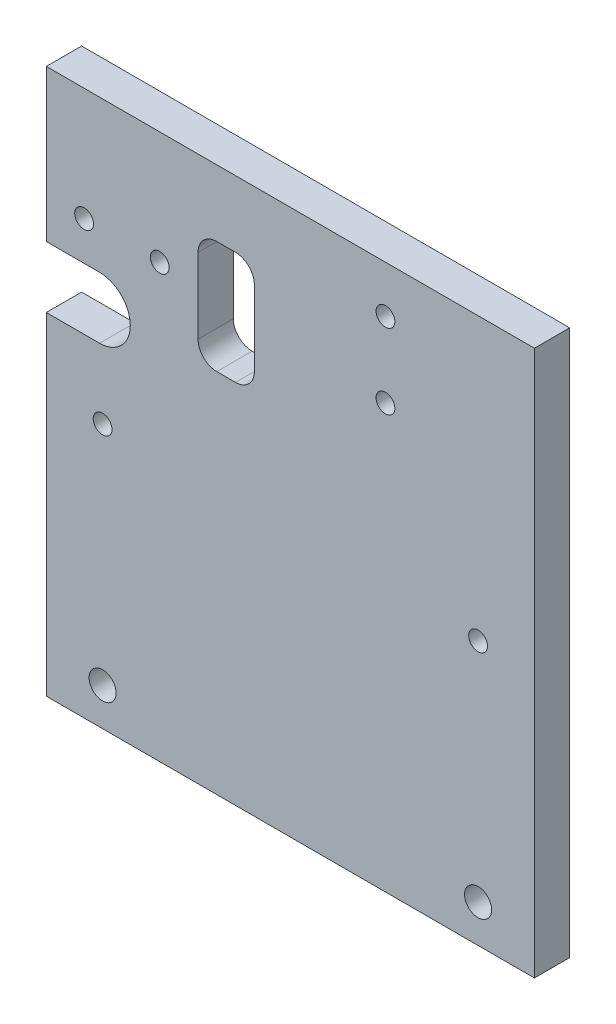
ISO-10303-21;
HEADER;
FILE_DESCRIPTION(('STEP AP214'),'2;1');
FILE_NAME('part.step','',(''),(''),'','','');
FILE_SCHEMA(('AUTOMOTIVE_DESIGN { 1 0 10303 214 1 1 1 1 }'));
ENDSEC;
DATA;
#1=APPLICATION_CONTEXT('core data for automotive mechanical design processes');
#2=APPLICATION_PROTOCOL_DEFINITION('international standard','automotive_design',2000,#1);
#3=PRODUCT_CONTEXT('',#1,'mechanical');
#4=PRODUCT('Part','Part','',(#3));
#5=PRODUCT_RELATED_PRODUCT_CATEGORY('part','',(#4));
#6=PRODUCT_DEFINITION_FORMATION('','',#4);
#7=PRODUCT_DEFINITION_CONTEXT('part definition',#1,'design');
#8=PRODUCT_DEFINITION('design','',#6,#7);
#9=PRODUCT_DEFINITION_SHAPE('','',#8);
#10=(LENGTH_UNIT() NAMED_UNIT(*) SI_UNIT(.MILLI.,.METRE.));
#11=(NAMED_UNIT(*) PLANE_ANGLE_UNIT() SI_UNIT($,.RADIAN.));
#12=(NAMED_UNIT(*) SI_UNIT($,.STERADIAN.) SOLID_ANGLE_UNIT());
#13=UNCERTAINTY_MEASURE_WITH_UNIT(LENGTH_MEASURE(1.E-05),#10,'distance_accuracy_value','');
#14=(GEOMETRIC_REPRESENTATION_CONTEXT(3) GLOBAL_UNCERTAINTY_ASSIGNED_CONTEXT((#13)) GLOBAL_UNIT_ASSIGNED_CONTEXT((#10,
#11,#12)) REPRESENTATION_CONTEXT('',''));
#15=CARTESIAN_POINT('',(0.,0.,0.));
#16=DIRECTION('',(0.,0.,1.));
#17=DIRECTION('',(1.,0.,0.));
#18=AXIS2_PLACEMENT_3D('',#15,#16,#17);
#19=CARTESIAN_POINT('',(-15.,-10.,9.4));
#20=DIRECTION('',(1.,0.,0.));
#21=DIRECTION('',(0.,0.,-1.));
#22=AXIS2_PLACEMENT_3D('',#19,#20,#21);
#23=PLANE('',#22);
#24=DIRECTION('',(0.,-1.,0.));
#25=VECTOR('',#24,1.);
#26=CARTESIAN_POINT('',(-15.,-10.,9.4));
#27=LINE('',#26,#25);
#28=CARTESIAN_POINT('',(-15.,78.5,9.4));
#29=VERTEX_POINT('',#28);
#30=CARTESIAN_POINT('',(-15.,-10.,9.4));
#31=VERTEX_POINT('',#30);
#32=EDGE_CURVE('E291',#29,#31,#27,.T.);
#33=ORIENTED_EDGE('',*,*,#32,.F.);
#34=DIRECTION('',(0.,0.,1.));
#35=VECTOR('',#34,1.);
#36=CARTESIAN_POINT('',(-15.,78.5,0.));
#37=LINE('',#36,#35);
#38=CARTESIAN_POINT('',(-15.,78.5,0.));
#39=VERTEX_POINT('',#38);
#40=EDGE_CURVE('E184',#39,#29,#37,.T.);
#41=ORIENTED_EDGE('',*,*,#40,.F.);
#42=DIRECTION('',(0.,-1.,0.));
#43=VECTOR('',#42,1.);
#44=CARTESIAN_POINT('',(-15.,-10.,0.));
#45=LINE('',#44,#43);
#46=CARTESIAN_POINT('',(-15.,-10.,0.));
#47=VERTEX_POINT('',#46);
#48=EDGE_CURVE('E172',#39,#47,#45,.T.);
#49=ORIENTED_EDGE('',*,*,#48,.T.);
#50=DIRECTION('',(0.,0.,-1.));
#51=VECTOR('',#50,1.);
#52=CARTESIAN_POINT('',(-15.,-10.,9.4));
#53=LINE('',#52,#51);
#54=EDGE_CURVE('E11',#31,#47,#53,.T.);
#55=ORIENTED_EDGE('',*,*,#54,.F.);
#56=EDGE_LOOP('',(#33,#41,#49,#55));
#57=FACE_BOUND('',#56,.T.);
#58=ADVANCED_FACE('F35',(#57),#23,.F.);
#59=CARTESIAN_POINT('',(0.,0.,9.4));
#60=DIRECTION('',(0.,0.,-1.));
#61=DIRECTION('',(-1.,0.,0.));
#62=AXIS2_PLACEMENT_3D('',#59,#60,#61);
#63=PLANE('',#62);
#64=CARTESIAN_POINT('',(-4.92685684419969,105.18600000001,9.4));
#65=DIRECTION('',(0.,0.,1.));
#66=DIRECTION('',(1.,0.,0.));
#67=AXIS2_PLACEMENT_3D('',#64,#65,#66);
#68=CIRCLE('',#67,2.5);
#69=CARTESIAN_POINT('',(-2.42685684419969,105.18600000001,9.4));
#70=VERTEX_POINT('',#69);
#71=EDGE_CURVE('E618',#70,#70,#68,.T.);
#72=ORIENTED_EDGE('',*,*,#71,.F.);
#73=EDGE_LOOP('',(#72));
#74=FACE_BOUND('',#73,.T.);
#75=CARTESIAN_POINT('',(15.2153431558003,105.18600000001,9.4));
#76=DIRECTION('',(0.,0.,1.));
#77=DIRECTION('',(1.,0.,0.));
#78=AXIS2_PLACEMENT_3D('',#75,#76,#77);
#79=CIRCLE('',#78,2.5);
#80=CARTESIAN_POINT('',(17.7153431558003,105.18600000001,9.4));
#81=VERTEX_POINT('',#80);
#82=EDGE_CURVE('E177',#81,#81,#79,.T.);
#83=ORIENTED_EDGE('',*,*,#82,.F.);
#84=EDGE_LOOP('',(#83));
#85=FACE_BOUND('',#84,.T.);
#86=DIRECTION('',(-1.,0.,0.));
#87=VECTOR('',#86,1.);
#88=CARTESIAN_POINT('',(35.4075461399999,87.5703674948168,9.4));
#89=LINE('',#88,#87);
#90=CARTESIAN_POINT('',(35.4075461399999,87.5703674948168,9.4));
#91=VERTEX_POINT('',#90);
#92=CARTESIAN_POINT('',(30.4075461399999,87.5703674948168,9.4));
#93=VERTEX_POINT('',#92);
#94=EDGE_CURVE('E210',#91,#93,#89,.T.);
#95=ORIENTED_EDGE('',*,*,#94,.T.);
#96=CARTESIAN_POINT('',(30.4075461399999,92.5703674948168,9.4));
#97=DIRECTION('',(0.,0.,-1.));
#98=DIRECTION('',(1.,0.,0.));
#99=AXIS2_PLACEMENT_3D('',#96,#97,#98);
#100=CIRCLE('',#99,5.);
#101=CARTESIAN_POINT('',(25.4075461399999,92.5703674948168,9.4));
#102=VERTEX_POINT('',#101);
#103=EDGE_CURVE('E190',#93,#102,#100,.T.);
#104=ORIENTED_EDGE('',*,*,#103,.T.);
#105=DIRECTION('',(0.,1.,0.));
#106=VECTOR('',#105,1.);
#107=CARTESIAN_POINT('',(25.4075461399999,112.570367494817,9.4));
#108=LINE('',#107,#106);
#109=CARTESIAN_POINT('',(25.4075461399999,112.570367494817,9.4));
#110=VERTEX_POINT('',#109);
#111=EDGE_CURVE('E193',#102,#110,#108,.T.);
#112=ORIENTED_EDGE('',*,*,#111,.T.);
#113=CARTESIAN_POINT('',(30.4075461399999,112.570367494817,9.4));
#114=DIRECTION('',(0.,0.,-1.));
#115=DIRECTION('',(1.,0.,0.));
#116=AXIS2_PLACEMENT_3D('',#113,#114,#115);
#117=CIRCLE('',#116,5.);
#118=CARTESIAN_POINT('',(30.4075461399999,117.570367494817,9.4));
#119=VERTEX_POINT('',#118);
#120=EDGE_CURVE('E58',#110,#119,#117,.T.);
#121=ORIENTED_EDGE('',*,*,#120,.T.);
#122=DIRECTION('',(1.,0.,0.));
#123=VECTOR('',#122,1.);
#124=CARTESIAN_POINT('',(35.4075461399999,117.570367494817,9.4));
#125=LINE('',#124,#123);
#126=CARTESIAN_POINT('',(35.4075461399999,117.570367494817,9.4));
#127=VERTEX_POINT('',#126);
#128=EDGE_CURVE('E198',#119,#127,#125,.T.);
#129=ORIENTED_EDGE('',*,*,#128,.T.);
#130=CARTESIAN_POINT('',(35.4075461399999,112.570367494817,9.4));
#131=DIRECTION('',(0.,0.,-1.));
#132=DIRECTION('',(1.,0.,0.));
#133=AXIS2_PLACEMENT_3D('',#130,#131,#132);
#134=CIRCLE('',#133,5.);
#135=CARTESIAN_POINT('',(40.4075461399999,112.570367494817,9.4));
#136=VERTEX_POINT('',#135);
#137=EDGE_CURVE('E201',#127,#136,#134,.T.);
#138=ORIENTED_EDGE('',*,*,#137,.T.);
#139=DIRECTION('',(0.,-1.,0.));
#140=VECTOR('',#139,1.);
#141=CARTESIAN_POINT('',(40.4075461399999,112.570367494817,9.4));
#142=LINE('',#141,#140);
#143=CARTESIAN_POINT('',(40.4075461399999,92.5703674948168,9.4));
#144=VERTEX_POINT('',#143);
#145=EDGE_CURVE('E204',#136,#144,#142,.T.);
#146=ORIENTED_EDGE('',*,*,#145,.T.);
#147=CARTESIAN_POINT('',(35.4075461399999,92.5703674948168,9.4));
#148=DIRECTION('',(0.,0.,-1.));
#149=DIRECTION('',(1.,0.,0.));
#150=AXIS2_PLACEMENT_3D('',#147,#148,#149);
#151=CIRCLE('',#150,5.);
#152=EDGE_CURVE('E207',#144,#91,#151,.T.);
#153=ORIENTED_EDGE('',*,*,#152,.T.);
#154=EDGE_LOOP('',(#95,#104,#112,#121,#129,#138,#146,#153));
#155=FACE_BOUND('',#154,.T.);
#156=CARTESIAN_POINT('',(75.3299999999999,122.76641156761,9.4));
#157=DIRECTION('',(0.,0.,1.));
#158=DIRECTION('',(1.,0.,0.));
#159=AXIS2_PLACEMENT_3D('',#156,#157,#158);
#160=CIRCLE('',#159,2.5);
#161=CARTESIAN_POINT('',(77.8299999999999,122.76641156761,9.4));
#162=VERTEX_POINT('',#161);
#163=EDGE_CURVE('E256',#162,#162,#160,.T.);
#164=ORIENTED_EDGE('',*,*,#163,.F.);
#165=EDGE_LOOP('',(#164));
#166=FACE_BOUND('',#165,.T.);
#167=CARTESIAN_POINT('',(75.3299999999999,102.76641156761,9.4));
#168=DIRECTION('',(0.,0.,1.));
#169=DIRECTION('',(1.,0.,0.));
#170=AXIS2_PLACEMENT_3D('',#167,#168,#169);
#171=CIRCLE('',#170,2.5);
#172=CARTESIAN_POINT('',(77.8299999999999,102.76641156761,9.4));
#173=VERTEX_POINT('',#172);
#174=EDGE_CURVE('E237',#173,#173,#171,.T.);
#175=ORIENTED_EDGE('',*,*,#174,.F.);
#176=EDGE_LOOP('',(#175));
#177=FACE_BOUND('',#176,.T.);
#178=CARTESIAN_POINT('',(-0.81,86.68,9.4));
#179=DIRECTION('',(0.,0.,1.));
#180=DIRECTION('',(-1.,0.,0.));
#181=AXIS2_PLACEMENT_3D('',#178,#179,#180);
#182=CIRCLE('',#181,8.18);
#183=CARTESIAN_POINT('',(-0.809999999999998,78.5,9.4));
#184=VERTEX_POINT('',#183);
#185=CARTESIAN_POINT('',(-0.81,94.86,9.4));
#186=VERTEX_POINT('',#185);
#187=EDGE_CURVE('E174',#184,#186,#182,.T.);
#188=ORIENTED_EDGE('',*,*,#187,.F.);
#189=DIRECTION('',(1.,0.,0.));
#190=VECTOR('',#189,1.);
#191=CARTESIAN_POINT('',(-15.,78.5,9.4));
#192=LINE('',#191,#190);
#193=EDGE_CURVE('E154',#29,#184,#192,.T.);
#194=ORIENTED_EDGE('',*,*,#193,.F.);
#195=ORIENTED_EDGE('',*,*,#32,.T.);
#196=DIRECTION('',(1.,0.,0.));
#197=VECTOR('',#196,1.);
#198=CARTESIAN_POINT('',(-15.,-10.,9.4));
#199=LINE('',#198,#197);
#200=CARTESIAN_POINT('',(115.,-10.,9.4));
#201=VERTEX_POINT('',#200);
#202=EDGE_CURVE('E290',#31,#201,#199,.T.);
#203=ORIENTED_EDGE('',*,*,#202,.T.);
#204=DIRECTION('',(0.,1.,0.));
#205=VECTOR('',#204,1.);
#206=CARTESIAN_POINT('',(115.,-10.,9.4));
#207=LINE('',#206,#205);
#208=CARTESIAN_POINT('',(115.,135.26,9.4));
#209=VERTEX_POINT('',#208);
#210=EDGE_CURVE('E293',#201,#209,#207,.T.);
#211=ORIENTED_EDGE('',*,*,#210,.T.);
#212=DIRECTION('',(-1.,0.,0.));
#213=VECTOR('',#212,1.);
#214=CARTESIAN_POINT('',(-15.,135.26,9.4));
#215=LINE('',#214,#213);
#216=CARTESIAN_POINT('',(-15.,135.26,9.4));
#217=VERTEX_POINT('',#216);
#218=EDGE_CURVE('E295',#209,#217,#215,.T.);
#219=ORIENTED_EDGE('',*,*,#218,.T.);
#220=CARTESIAN_POINT('',(-15.,94.86,9.4));
#221=VERTEX_POINT('',#220);
#222=EDGE_CURVE('E287',#217,#221,#27,.T.);
#223=ORIENTED_EDGE('',*,*,#222,.T.);
#224=DIRECTION('',(-1.,0.,0.));
#225=VECTOR('',#224,1.);
#226=CARTESIAN_POINT('',(-15.,94.86,9.4));
#227=LINE('',#226,#225);
#228=EDGE_CURVE('E50',#186,#221,#227,.T.);
#229=ORIENTED_EDGE('',*,*,#228,.F.);
#230=EDGE_LOOP('',(#188,#194,#195,#203,#211,#219,#223,#229));
#231=FACE_BOUND('',#230,.T.);
#232=CARTESIAN_POINT('',(0.,0.,9.4));
#233=DIRECTION('',(0.,0.,1.));
#234=DIRECTION('',(1.,0.,0.));
#235=AXIS2_PLACEMENT_3D('',#232,#233,#234);
#236=CIRCLE('',#235,3.6);
#237=CARTESIAN_POINT('',(3.6,0.,9.4));
#238=VERTEX_POINT('',#237);
#239=EDGE_CURVE('E282',#238,#238,#236,.T.);
#240=ORIENTED_EDGE('',*,*,#239,.F.);
#241=EDGE_LOOP('',(#240));
#242=FACE_BOUND('',#241,.T.);
#243=CARTESIAN_POINT('',(100.,60.26,9.4));
#244=DIRECTION('',(0.,0.,1.));
#245=DIRECTION('',(1.,0.,0.));
#246=AXIS2_PLACEMENT_3D('',#243,#244,#245);
#247=CIRCLE('',#246,2.5);
#248=CARTESIAN_POINT('',(102.5,60.26,9.4));
#249=VERTEX_POINT('',#248);
#250=EDGE_CURVE('E276',#249,#249,#247,.T.);
#251=ORIENTED_EDGE('',*,*,#250,.F.);
#252=EDGE_LOOP('',(#251));
#253=FACE_BOUND('',#252,.T.);
#254=CARTESIAN_POINT('',(0.,60.26,9.4));
#255=DIRECTION('',(0.,0.,1.));
#256=DIRECTION('',(1.,0.,0.));
#257=AXIS2_PLACEMENT_3D('',#254,#255,#256);
#258=CIRCLE('',#257,2.5);
#259=CARTESIAN_POINT('',(2.5,60.26,9.4));
#260=VERTEX_POINT('',#259);
#261=EDGE_CURVE('E270',#260,#260,#258,.T.);
#262=ORIENTED_EDGE('',*,*,#261,.F.);
#263=EDGE_LOOP('',(#262));
#264=FACE_BOUND('',#263,.T.);
#265=CARTESIAN_POINT('',(100.,0.,9.4));
#266=DIRECTION('',(0.,0.,1.));
#267=DIRECTION('',(1.,0.,0.));
#268=AXIS2_PLACEMENT_3D('',#265,#266,#267);
#269=CIRCLE('',#268,3.6);
#270=CARTESIAN_POINT('',(103.6,0.,9.4));
#271=VERTEX_POINT('',#270);
#272=EDGE_CURVE('E264',#271,#271,#269,.T.);
#273=ORIENTED_EDGE('',*,*,#272,.F.);
#274=EDGE_LOOP('',(#273));
#275=FACE_BOUND('',#274,.T.);
#276=ADVANCED_FACE('F329',(#74,#85,#155,#166,#177,#231,#242,#253,#264,#275),#63,.F.);
#277=CARTESIAN_POINT('',(0.,0.,0.));
#278=DIRECTION('',(0.,0.,-1.));
#279=DIRECTION('',(-1.,0.,0.));
#280=AXIS2_PLACEMENT_3D('',#277,#278,#279);
#281=PLANE('',#280);
#282=CARTESIAN_POINT('',(-4.92685684419969,105.18600000001,0.));
#283=DIRECTION('',(0.,0.,1.));
#284=DIRECTION('',(1.,0.,0.));
#285=AXIS2_PLACEMENT_3D('',#282,#283,#284);
#286=CIRCLE('',#285,2.5);
#287=CARTESIAN_POINT('',(-2.42685684419969,105.18600000001,0.));
#288=VERTEX_POINT('',#287);
#289=EDGE_CURVE('E182',#288,#288,#286,.T.);
#290=ORIENTED_EDGE('',*,*,#289,.T.);
#291=EDGE_LOOP('',(#290));
#292=FACE_BOUND('',#291,.T.);
#293=CARTESIAN_POINT('',(15.2153431558003,105.18600000001,0.));
#294=DIRECTION('',(0.,0.,1.));
#295=DIRECTION('',(1.,0.,0.));
#296=AXIS2_PLACEMENT_3D('',#293,#294,#295);
#297=CIRCLE('',#296,2.5);
#298=CARTESIAN_POINT('',(17.7153431558003,105.18600000001,0.));
#299=VERTEX_POINT('',#298);
#300=EDGE_CURVE('E619',#299,#299,#297,.T.);
#301=ORIENTED_EDGE('',*,*,#300,.T.);
#302=EDGE_LOOP('',(#301));
#303=FACE_BOUND('',#302,.T.);
#304=DIRECTION('',(1.,0.,0.));
#305=VECTOR('',#304,1.);
#306=CARTESIAN_POINT('',(-15.,78.5,0.));
#307=LINE('',#306,#305);
#308=CARTESIAN_POINT('',(-0.809999999999998,78.5,0.));
#309=VERTEX_POINT('',#308);
#310=EDGE_CURVE('E151',#39,#309,#307,.T.);
#311=ORIENTED_EDGE('',*,*,#310,.T.);
#312=CARTESIAN_POINT('',(-0.81,86.68,0.));
#313=DIRECTION('',(0.,0.,1.));
#314=DIRECTION('',(-1.,0.,0.));
#315=AXIS2_PLACEMENT_3D('',#312,#313,#314);
#316=CIRCLE('',#315,8.18);
#317=CARTESIAN_POINT('',(-0.81,94.86,0.));
#318=VERTEX_POINT('',#317);
#319=EDGE_CURVE('E162',#309,#318,#316,.T.);
#320=ORIENTED_EDGE('',*,*,#319,.T.);
#321=DIRECTION('',(-1.,0.,0.));
#322=VECTOR('',#321,1.);
#323=CARTESIAN_POINT('',(-15.,94.86,0.));
#324=LINE('',#323,#322);
#325=CARTESIAN_POINT('',(-15.,94.86,0.));
#326=VERTEX_POINT('',#325);
#327=EDGE_CURVE('E159',#318,#326,#324,.T.);
#328=ORIENTED_EDGE('',*,*,#327,.T.);
#329=CARTESIAN_POINT('',(-15.,135.26,0.));
#330=VERTEX_POINT('',#329);
#331=EDGE_CURVE('E298',#330,#326,#45,.T.);
#332=ORIENTED_EDGE('',*,*,#331,.F.);
#333=DIRECTION('',(-1.,0.,0.));
#334=VECTOR('',#333,1.);
#335=CARTESIAN_POINT('',(-15.,135.26,0.));
#336=LINE('',#335,#334);
#337=CARTESIAN_POINT('',(115.,135.26,0.));
#338=VERTEX_POINT('',#337);
#339=EDGE_CURVE('E305',#338,#330,#336,.T.);
#340=ORIENTED_EDGE('',*,*,#339,.F.);
#341=DIRECTION('',(0.,1.,0.));
#342=VECTOR('',#341,1.);
#343=CARTESIAN_POINT('',(115.,-10.,0.));
#344=LINE('',#343,#342);
#345=CARTESIAN_POINT('',(115.,-10.,0.));
#346=VERTEX_POINT('',#345);
#347=EDGE_CURVE('E303',#346,#338,#344,.T.);
#348=ORIENTED_EDGE('',*,*,#347,.F.);
#349=DIRECTION('',(1.,0.,0.));
#350=VECTOR('',#349,1.);
#351=CARTESIAN_POINT('',(-15.,-10.,0.));
#352=LINE('',#351,#350);
#353=EDGE_CURVE('E301',#47,#346,#352,.T.);
#354=ORIENTED_EDGE('',*,*,#353,.F.);
#355=ORIENTED_EDGE('',*,*,#48,.F.);
#356=EDGE_LOOP('',(#311,#320,#328,#332,#340,#348,#354,#355));
#357=FACE_BOUND('',#356,.T.);
#358=CARTESIAN_POINT('',(30.4075461399999,92.5703674948168,0.));
#359=DIRECTION('',(0.,0.,-1.));
#360=DIRECTION('',(1.,0.,0.));
#361=AXIS2_PLACEMENT_3D('',#358,#359,#360);
#362=CIRCLE('',#361,5.);
#363=CARTESIAN_POINT('',(30.4075461399999,87.5703674948168,0.));
#364=VERTEX_POINT('',#363);
#365=CARTESIAN_POINT('',(25.4075461399999,92.5703674948168,0.));
#366=VERTEX_POINT('',#365);
#367=EDGE_CURVE('E186',#364,#366,#362,.T.);
#368=ORIENTED_EDGE('',*,*,#367,.F.);
#369=DIRECTION('',(-1.,0.,0.));
#370=VECTOR('',#369,1.);
#371=CARTESIAN_POINT('',(35.4075461399999,87.5703674948168,0.));
#372=LINE('',#371,#370);
#373=CARTESIAN_POINT('',(35.4075461399999,87.5703674948168,0.));
#374=VERTEX_POINT('',#373);
#375=EDGE_CURVE('E194',#374,#364,#372,.T.);
#376=ORIENTED_EDGE('',*,*,#375,.F.);
#377=CARTESIAN_POINT('',(35.4075461399999,92.5703674948168,0.));
#378=DIRECTION('',(0.,0.,-1.));
#379=DIRECTION('',(1.,0.,0.));
#380=AXIS2_PLACEMENT_3D('',#377,#378,#379);
#381=CIRCLE('',#380,5.);
#382=CARTESIAN_POINT('',(40.4075461399999,92.5703674948168,0.));
#383=VERTEX_POINT('',#382);
#384=EDGE_CURVE('E230',#383,#374,#381,.T.);
#385=ORIENTED_EDGE('',*,*,#384,.F.);
#386=DIRECTION('',(0.,-1.,0.));
#387=VECTOR('',#386,1.);
#388=CARTESIAN_POINT('',(40.4075461399999,112.570367494817,0.));
#389=LINE('',#388,#387);
#390=CARTESIAN_POINT('',(40.4075461399999,112.570367494817,0.));
#391=VERTEX_POINT('',#390);
#392=EDGE_CURVE('E227',#391,#383,#389,.T.);
#393=ORIENTED_EDGE('',*,*,#392,.F.);
#394=CARTESIAN_POINT('',(35.4075461399999,112.570367494817,0.));
#395=DIRECTION('',(0.,0.,-1.));
#396=DIRECTION('',(1.,0.,0.));
#397=AXIS2_PLACEMENT_3D('',#394,#395,#396);
#398=CIRCLE('',#397,5.);
#399=CARTESIAN_POINT('',(35.4075461399999,117.570367494817,0.));
#400=VERTEX_POINT('',#399);
#401=EDGE_CURVE('E224',#400,#391,#398,.T.);
#402=ORIENTED_EDGE('',*,*,#401,.F.);
#403=DIRECTION('',(1.,0.,0.));
#404=VECTOR('',#403,1.);
#405=CARTESIAN_POINT('',(35.4075461399999,117.570367494817,0.));
#406=LINE('',#405,#404);
#407=CARTESIAN_POINT('',(30.4075461399999,117.570367494817,0.));
#408=VERTEX_POINT('',#407);
#409=EDGE_CURVE('E221',#408,#400,#406,.T.);
#410=ORIENTED_EDGE('',*,*,#409,.F.);
#411=CARTESIAN_POINT('',(30.4075461399999,112.570367494817,0.));
#412=DIRECTION('',(0.,0.,-1.));
#413=DIRECTION('',(1.,0.,0.));
#414=AXIS2_PLACEMENT_3D('',#411,#412,#413);
#415=CIRCLE('',#414,5.);
#416=CARTESIAN_POINT('',(25.4075461399999,112.570367494817,0.));
#417=VERTEX_POINT('',#416);
#418=EDGE_CURVE('E218',#417,#408,#415,.T.);
#419=ORIENTED_EDGE('',*,*,#418,.F.);
#420=DIRECTION('',(0.,1.,0.));
#421=VECTOR('',#420,1.);
#422=CARTESIAN_POINT('',(25.4075461399999,112.570367494817,0.));
#423=LINE('',#422,#421);
#424=EDGE_CURVE('E215',#366,#417,#423,.T.);
#425=ORIENTED_EDGE('',*,*,#424,.F.);
#426=EDGE_LOOP('',(#368,#376,#385,#393,#402,#410,#419,#425));
#427=FACE_BOUND('',#426,.T.);
#428=CARTESIAN_POINT('',(75.3299999999999,122.76641156761,0.));
#429=DIRECTION('',(0.,0.,1.));
#430=DIRECTION('',(1.,0.,0.));
#431=AXIS2_PLACEMENT_3D('',#428,#429,#430);
#432=CIRCLE('',#431,2.5);
#433=CARTESIAN_POINT('',(77.8299999999999,122.76641156761,0.));
#434=VERTEX_POINT('',#433);
#435=EDGE_CURVE('E252',#434,#434,#432,.T.);
#436=ORIENTED_EDGE('',*,*,#435,.T.);
#437=EDGE_LOOP('',(#436));
#438=FACE_BOUND('',#437,.T.);
#439=CARTESIAN_POINT('',(75.3299999999999,102.76641156761,0.));
#440=DIRECTION('',(0.,0.,1.));
#441=DIRECTION('',(1.,0.,0.));
#442=AXIS2_PLACEMENT_3D('',#439,#440,#441);
#443=CIRCLE('',#442,2.5);
#444=CARTESIAN_POINT('',(77.8299999999999,102.76641156761,0.));
#445=VERTEX_POINT('',#444);
#446=EDGE_CURVE('E259',#445,#445,#443,.T.);
#447=ORIENTED_EDGE('',*,*,#446,.T.);
#448=EDGE_LOOP('',(#447));
#449=FACE_BOUND('',#448,.T.);
#450=CARTESIAN_POINT('',(0.,60.26,0.));
#451=DIRECTION('',(0.,0.,1.));
#452=DIRECTION('',(1.,0.,0.));
#453=AXIS2_PLACEMENT_3D('',#450,#451,#452);
#454=CIRCLE('',#453,2.5);
#455=CARTESIAN_POINT('',(2.5,60.26,0.));
#456=VERTEX_POINT('',#455);
#457=EDGE_CURVE('E267',#456,#456,#454,.T.);
#458=ORIENTED_EDGE('',*,*,#457,.T.);
#459=EDGE_LOOP('',(#458));
#460=FACE_BOUND('',#459,.T.);
#461=CARTESIAN_POINT('',(0.,0.,0.));
#462=DIRECTION('',(0.,0.,1.));
#463=DIRECTION('',(1.,0.,0.));
#464=AXIS2_PLACEMENT_3D('',#461,#462,#463);
#465=CIRCLE('',#464,3.6);
#466=CARTESIAN_POINT('',(3.6,0.,0.));
#467=VERTEX_POINT('',#466);
#468=EDGE_CURVE('E279',#467,#467,#465,.T.);
#469=ORIENTED_EDGE('',*,*,#468,.T.);
#470=EDGE_LOOP('',(#469));
#471=FACE_BOUND('',#470,.T.);
#472=CARTESIAN_POINT('',(100.,60.26,0.));
#473=DIRECTION('',(0.,0.,1.));
#474=DIRECTION('',(1.,0.,0.));
#475=AXIS2_PLACEMENT_3D('',#472,#473,#474);
#476=CIRCLE('',#475,2.5);
#477=CARTESIAN_POINT('',(102.5,60.26,0.));
#478=VERTEX_POINT('',#477);
#479=EDGE_CURVE('E273',#478,#478,#476,.T.);
#480=ORIENTED_EDGE('',*,*,#479,.T.);
#481=EDGE_LOOP('',(#480));
#482=FACE_BOUND('',#481,.T.);
#483=CARTESIAN_POINT('',(100.,0.,0.));
#484=DIRECTION('',(0.,0.,1.));
#485=DIRECTION('',(1.,0.,0.));
#486=AXIS2_PLACEMENT_3D('',#483,#484,#485);
#487=CIRCLE('',#486,3.6);
#488=CARTESIAN_POINT('',(103.6,0.,0.));
#489=VERTEX_POINT('',#488);
#490=EDGE_CURVE('E255',#489,#489,#487,.T.);
#491=ORIENTED_EDGE('',*,*,#490,.T.);
#492=EDGE_LOOP('',(#491));
#493=FACE_BOUND('',#492,.T.);
#494=ADVANCED_FACE('F169',(#292,#303,#357,#427,#438,#449,#460,#471,#482,#493),#281,.T.);
#495=ORIENTED_EDGE('',*,*,#331,.T.);
#496=DIRECTION('',(0.,0.,1.));
#497=VECTOR('',#496,1.);
#498=CARTESIAN_POINT('',(-15.,94.86,0.));
#499=LINE('',#498,#497);
#500=EDGE_CURVE('E187',#326,#221,#499,.T.);
#501=ORIENTED_EDGE('',*,*,#500,.T.);
#502=ORIENTED_EDGE('',*,*,#222,.F.);
#503=DIRECTION('',(0.,0.,-1.));
#504=VECTOR('',#503,1.);
#505=CARTESIAN_POINT('',(-15.,135.26,9.4));
#506=LINE('',#505,#504);
#507=EDGE_CURVE('E297',#217,#330,#506,.T.);
#508=ORIENTED_EDGE('',*,*,#507,.T.);
#509=EDGE_LOOP('',(#495,#501,#502,#508));
#510=FACE_BOUND('',#509,.T.);
#511=ADVANCED_FACE('F37',(#510),#23,.F.);
#512=CARTESIAN_POINT('',(-15.,-10.,9.4));
#513=DIRECTION('',(0.,1.,0.));
#514=DIRECTION('',(0.,0.,1.));
#515=AXIS2_PLACEMENT_3D('',#512,#513,#514);
#516=PLANE('',#515);
#517=ORIENTED_EDGE('',*,*,#353,.T.);
#518=DIRECTION('',(0.,0.,-1.));
#519=VECTOR('',#518,1.);
#520=CARTESIAN_POINT('',(115.,-10.,9.4));
#521=LINE('',#520,#519);
#522=EDGE_CURVE('E43',#201,#346,#521,.T.);
#523=ORIENTED_EDGE('',*,*,#522,.F.);
#524=ORIENTED_EDGE('',*,*,#202,.F.);
#525=ORIENTED_EDGE('',*,*,#54,.T.);
#526=EDGE_LOOP('',(#517,#523,#524,#525));
#527=FACE_BOUND('',#526,.T.);
#528=ADVANCED_FACE('F333',(#527),#516,.F.);
#529=CARTESIAN_POINT('',(115.,-10.,9.4));
#530=DIRECTION('',(-1.,0.,0.));
#531=DIRECTION('',(0.,0.,1.));
#532=AXIS2_PLACEMENT_3D('',#529,#530,#531);
#533=PLANE('',#532);
#534=ORIENTED_EDGE('',*,*,#347,.T.);
#535=DIRECTION('',(0.,0.,-1.));
#536=VECTOR('',#535,1.);
#537=CARTESIAN_POINT('',(115.,135.26,9.4));
#538=LINE('',#537,#536);
#539=EDGE_CURVE('E309',#209,#338,#538,.T.);
#540=ORIENTED_EDGE('',*,*,#539,.F.);
#541=ORIENTED_EDGE('',*,*,#210,.F.);
#542=ORIENTED_EDGE('',*,*,#522,.T.);
#543=EDGE_LOOP('',(#534,#540,#541,#542));
#544=FACE_BOUND('',#543,.T.);
#545=ADVANCED_FACE('F316',(#544),#533,.F.);
#546=CARTESIAN_POINT('',(-15.,135.26,9.4));
#547=DIRECTION('',(0.,-1.,0.));
#548=DIRECTION('',(0.,0.,-1.));
#549=AXIS2_PLACEMENT_3D('',#546,#547,#548);
#550=PLANE('',#549);
#551=ORIENTED_EDGE('',*,*,#339,.T.);
#552=ORIENTED_EDGE('',*,*,#507,.F.);
#553=ORIENTED_EDGE('',*,*,#218,.F.);
#554=ORIENTED_EDGE('',*,*,#539,.T.);
#555=EDGE_LOOP('',(#551,#552,#553,#554));
#556=FACE_BOUND('',#555,.T.);
#557=ADVANCED_FACE('F324',(#556),#550,.F.);
#558=CARTESIAN_POINT('',(0.,0.,9.4));
#559=DIRECTION('',(0.,0.,-1.));
#560=DIRECTION('',(-1.,0.,0.));
#561=AXIS2_PLACEMENT_3D('',#558,#559,#560);
#562=CYLINDRICAL_SURFACE('',#561,3.6);
#563=ORIENTED_EDGE('',*,*,#239,.T.);
#564=EDGE_LOOP('',(#563));
#565=FACE_BOUND('',#564,.T.);
#566=ORIENTED_EDGE('',*,*,#468,.F.);
#567=EDGE_LOOP('',(#566));
#568=FACE_BOUND('',#567,.T.);
#569=ADVANCED_FACE('F359',(#565,#568),#562,.F.);
#570=CARTESIAN_POINT('',(100.,60.26,9.4));
#571=DIRECTION('',(0.,0.,-1.));
#572=DIRECTION('',(-1.,0.,0.));
#573=AXIS2_PLACEMENT_3D('',#570,#571,#572);
#574=CYLINDRICAL_SURFACE('',#573,2.5);
#575=ORIENTED_EDGE('',*,*,#250,.T.);
#576=EDGE_LOOP('',(#575));
#577=FACE_BOUND('',#576,.T.);
#578=ORIENTED_EDGE('',*,*,#479,.F.);
#579=EDGE_LOOP('',(#578));
#580=FACE_BOUND('',#579,.T.);
#581=ADVANCED_FACE('F378',(#577,#580),#574,.F.);
#582=CARTESIAN_POINT('',(0.,60.26,9.4));
#583=DIRECTION('',(0.,0.,-1.));
#584=DIRECTION('',(-1.,0.,0.));
#585=AXIS2_PLACEMENT_3D('',#582,#583,#584);
#586=CYLINDRICAL_SURFACE('',#585,2.5);
#587=ORIENTED_EDGE('',*,*,#261,.T.);
#588=EDGE_LOOP('',(#587));
#589=FACE_BOUND('',#588,.T.);
#590=ORIENTED_EDGE('',*,*,#457,.F.);
#591=EDGE_LOOP('',(#590));
#592=FACE_BOUND('',#591,.T.);
#593=ADVANCED_FACE('F387',(#589,#592),#586,.F.);
#594=CARTESIAN_POINT('',(100.,0.,9.4));
#595=DIRECTION('',(0.,0.,-1.));
#596=DIRECTION('',(-1.,0.,0.));
#597=AXIS2_PLACEMENT_3D('',#594,#595,#596);
#598=CYLINDRICAL_SURFACE('',#597,3.6);
#599=ORIENTED_EDGE('',*,*,#272,.T.);
#600=EDGE_LOOP('',(#599));
#601=FACE_BOUND('',#600,.T.);
#602=ORIENTED_EDGE('',*,*,#490,.F.);
#603=EDGE_LOOP('',(#602));
#604=FACE_BOUND('',#603,.T.);
#605=ADVANCED_FACE('F397',(#601,#604),#598,.F.);
#606=CARTESIAN_POINT('',(75.3299999999999,102.76641156761,0.));
#607=DIRECTION('',(0.,0.,1.));
#608=DIRECTION('',(1.,0.,0.));
#609=AXIS2_PLACEMENT_3D('',#606,#607,#608);
#610=CYLINDRICAL_SURFACE('',#609,2.5);
#611=ORIENTED_EDGE('',*,*,#446,.F.);
#612=EDGE_LOOP('',(#611));
#613=FACE_BOUND('',#612,.T.);
#614=ORIENTED_EDGE('',*,*,#174,.T.);
#615=EDGE_LOOP('',(#614));
#616=FACE_BOUND('',#615,.T.);
#617=ADVANCED_FACE('F407',(#613,#616),#610,.F.);
#618=CARTESIAN_POINT('',(75.3299999999999,122.76641156761,0.));
#619=DIRECTION('',(0.,0.,1.));
#620=DIRECTION('',(1.,0.,0.));
#621=AXIS2_PLACEMENT_3D('',#618,#619,#620);
#622=CYLINDRICAL_SURFACE('',#621,2.5);
#623=ORIENTED_EDGE('',*,*,#435,.F.);
#624=EDGE_LOOP('',(#623));
#625=FACE_BOUND('',#624,.T.);
#626=ORIENTED_EDGE('',*,*,#163,.T.);
#627=EDGE_LOOP('',(#626));
#628=FACE_BOUND('',#627,.T.);
#629=ADVANCED_FACE('F417',(#625,#628),#622,.F.);
#630=CARTESIAN_POINT('',(30.4075461399999,92.5703674948168,9.4));
#631=DIRECTION('',(0.,0.,-1.));
#632=DIRECTION('',(-1.,0.,0.));
#633=AXIS2_PLACEMENT_3D('',#630,#631,#632);
#634=CYLINDRICAL_SURFACE('',#633,5.);
#635=ORIENTED_EDGE('',*,*,#367,.T.);
#636=DIRECTION('',(0.,0.,-1.));
#637=VECTOR('',#636,1.);
#638=CARTESIAN_POINT('',(25.4075461399999,92.5703674948168,9.4));
#639=LINE('',#638,#637);
#640=EDGE_CURVE('E213',#102,#366,#639,.T.);
#641=ORIENTED_EDGE('',*,*,#640,.F.);
#642=ORIENTED_EDGE('',*,*,#103,.F.);
#643=DIRECTION('',(0.,0.,-1.));
#644=VECTOR('',#643,1.);
#645=CARTESIAN_POINT('',(30.4075461399999,87.5703674948168,9.4));
#646=LINE('',#645,#644);
#647=EDGE_CURVE('E235',#93,#364,#646,.T.);
#648=ORIENTED_EDGE('',*,*,#647,.T.);
#649=EDGE_LOOP('',(#635,#641,#642,#648));
#650=FACE_BOUND('',#649,.T.);
#651=ADVANCED_FACE('F427',(#650),#634,.F.);
#652=CARTESIAN_POINT('',(35.4075461399999,87.5703674948168,9.4));
#653=DIRECTION('',(0.,-1.,0.));
#654=DIRECTION('',(0.,0.,-1.));
#655=AXIS2_PLACEMENT_3D('',#652,#653,#654);
#656=PLANE('',#655);
#657=ORIENTED_EDGE('',*,*,#375,.T.);
#658=ORIENTED_EDGE('',*,*,#647,.F.);
#659=ORIENTED_EDGE('',*,*,#94,.F.);
#660=DIRECTION('',(0.,0.,-1.));
#661=VECTOR('',#660,1.);
#662=CARTESIAN_POINT('',(35.4075461399999,87.5703674948168,9.4));
#663=LINE('',#662,#661);
#664=EDGE_CURVE('E238',#91,#374,#663,.T.);
#665=ORIENTED_EDGE('',*,*,#664,.T.);
#666=EDGE_LOOP('',(#657,#658,#659,#665));
#667=FACE_BOUND('',#666,.T.);
#668=ADVANCED_FACE('F437',(#667),#656,.F.);
#669=CARTESIAN_POINT('',(35.4075461399999,92.5703674948168,9.4));
#670=DIRECTION('',(0.,0.,-1.));
#671=DIRECTION('',(-1.,0.,0.));
#672=AXIS2_PLACEMENT_3D('',#669,#670,#671);
#673=CYLINDRICAL_SURFACE('',#672,5.);
#674=ORIENTED_EDGE('',*,*,#384,.T.);
#675=ORIENTED_EDGE('',*,*,#664,.F.);
#676=ORIENTED_EDGE('',*,*,#152,.F.);
#677=DIRECTION('',(0.,0.,-1.));
#678=VECTOR('',#677,1.);
#679=CARTESIAN_POINT('',(40.4075461399999,92.5703674948168,9.4));
#680=LINE('',#679,#678);
#681=EDGE_CURVE('E240',#144,#383,#680,.T.);
#682=ORIENTED_EDGE('',*,*,#681,.T.);
#683=EDGE_LOOP('',(#674,#675,#676,#682));
#684=FACE_BOUND('',#683,.T.);
#685=ADVANCED_FACE('F447',(#684),#673,.F.);
#686=CARTESIAN_POINT('',(40.4075461399999,112.570367494817,9.4));
#687=DIRECTION('',(1.,0.,0.));
#688=DIRECTION('',(0.,0.,-1.));
#689=AXIS2_PLACEMENT_3D('',#686,#687,#688);
#690=PLANE('',#689);
#691=ORIENTED_EDGE('',*,*,#392,.T.);
#692=ORIENTED_EDGE('',*,*,#681,.F.);
#693=ORIENTED_EDGE('',*,*,#145,.F.);
#694=DIRECTION('',(0.,0.,-1.));
#695=VECTOR('',#694,1.);
#696=CARTESIAN_POINT('',(40.4075461399999,112.570367494817,9.4));
#697=LINE('',#696,#695);
#698=EDGE_CURVE('E242',#136,#391,#697,.T.);
#699=ORIENTED_EDGE('',*,*,#698,.T.);
#700=EDGE_LOOP('',(#691,#692,#693,#699));
#701=FACE_BOUND('',#700,.T.);
#702=ADVANCED_FACE('F457',(#701),#690,.F.);
#703=CARTESIAN_POINT('',(35.4075461399999,112.570367494817,9.4));
#704=DIRECTION('',(0.,0.,-1.));
#705=DIRECTION('',(-1.,0.,0.));
#706=AXIS2_PLACEMENT_3D('',#703,#704,#705);
#707=CYLINDRICAL_SURFACE('',#706,5.);
#708=ORIENTED_EDGE('',*,*,#401,.T.);
#709=ORIENTED_EDGE('',*,*,#698,.F.);
#710=ORIENTED_EDGE('',*,*,#137,.F.);
#711=DIRECTION('',(0.,0.,-1.));
#712=VECTOR('',#711,1.);
#713=CARTESIAN_POINT('',(35.4075461399999,117.570367494817,9.4));
#714=LINE('',#713,#712);
#715=EDGE_CURVE('E244',#127,#400,#714,.T.);
#716=ORIENTED_EDGE('',*,*,#715,.T.);
#717=EDGE_LOOP('',(#708,#709,#710,#716));
#718=FACE_BOUND('',#717,.T.);
#719=ADVANCED_FACE('F467',(#718),#707,.F.);
#720=CARTESIAN_POINT('',(35.4075461399999,117.570367494817,9.4));
#721=DIRECTION('',(0.,1.,0.));
#722=DIRECTION('',(0.,0.,1.));
#723=AXIS2_PLACEMENT_3D('',#720,#721,#722);
#724=PLANE('',#723);
#725=ORIENTED_EDGE('',*,*,#409,.T.);
#726=ORIENTED_EDGE('',*,*,#715,.F.);
#727=ORIENTED_EDGE('',*,*,#128,.F.);
#728=DIRECTION('',(0.,0.,-1.));
#729=VECTOR('',#728,1.);
#730=CARTESIAN_POINT('',(30.4075461399999,117.570367494817,9.4));
#731=LINE('',#730,#729);
#732=EDGE_CURVE('E246',#119,#408,#731,.T.);
#733=ORIENTED_EDGE('',*,*,#732,.T.);
#734=EDGE_LOOP('',(#725,#726,#727,#733));
#735=FACE_BOUND('',#734,.T.);
#736=ADVANCED_FACE('F477',(#735),#724,.F.);
#737=CARTESIAN_POINT('',(30.4075461399999,112.570367494817,9.4));
#738=DIRECTION('',(0.,0.,-1.));
#739=DIRECTION('',(-1.,0.,0.));
#740=AXIS2_PLACEMENT_3D('',#737,#738,#739);
#741=CYLINDRICAL_SURFACE('',#740,5.);
#742=ORIENTED_EDGE('',*,*,#418,.T.);
#743=ORIENTED_EDGE('',*,*,#732,.F.);
#744=ORIENTED_EDGE('',*,*,#120,.F.);
#745=DIRECTION('',(0.,0.,-1.));
#746=VECTOR('',#745,1.);
#747=CARTESIAN_POINT('',(25.4075461399999,112.570367494817,9.4));
#748=LINE('',#747,#746);
#749=EDGE_CURVE('E248',#110,#417,#748,.T.);
#750=ORIENTED_EDGE('',*,*,#749,.T.);
#751=EDGE_LOOP('',(#742,#743,#744,#750));
#752=FACE_BOUND('',#751,.T.);
#753=ADVANCED_FACE('F487',(#752),#741,.F.);
#754=CARTESIAN_POINT('',(25.4075461399999,112.570367494817,9.4));
#755=DIRECTION('',(-1.,0.,0.));
#756=DIRECTION('',(0.,-1.,0.));
#757=AXIS2_PLACEMENT_3D('',#754,#755,#756);
#758=PLANE('',#757);
#759=ORIENTED_EDGE('',*,*,#424,.T.);
#760=ORIENTED_EDGE('',*,*,#749,.F.);
#761=ORIENTED_EDGE('',*,*,#111,.F.);
#762=ORIENTED_EDGE('',*,*,#640,.T.);
#763=EDGE_LOOP('',(#759,#760,#761,#762));
#764=FACE_BOUND('',#763,.T.);
#765=ADVANCED_FACE('F495',(#764),#758,.F.);
#766=CARTESIAN_POINT('',(-15.,78.5,0.));
#767=DIRECTION('',(0.,-1.,0.));
#768=DIRECTION('',(0.,0.,-1.));
#769=AXIS2_PLACEMENT_3D('',#766,#767,#768);
#770=PLANE('',#769);
#771=ORIENTED_EDGE('',*,*,#193,.T.);
#772=DIRECTION('',(0.,0.,1.));
#773=VECTOR('',#772,1.);
#774=CARTESIAN_POINT('',(-0.809999999999998,78.5,0.));
#775=LINE('',#774,#773);
#776=EDGE_CURVE('E147',#309,#184,#775,.T.);
#777=ORIENTED_EDGE('',*,*,#776,.F.);
#778=ORIENTED_EDGE('',*,*,#310,.F.);
#779=ORIENTED_EDGE('',*,*,#40,.T.);
#780=EDGE_LOOP('',(#771,#777,#778,#779));
#781=FACE_BOUND('',#780,.T.);
#782=ADVANCED_FACE('F149',(#781),#770,.F.);
#783=CARTESIAN_POINT('',(-15.,94.86,0.));
#784=DIRECTION('',(0.,1.,0.));
#785=DIRECTION('',(0.,0.,1.));
#786=AXIS2_PLACEMENT_3D('',#783,#784,#785);
#787=PLANE('',#786);
#788=ORIENTED_EDGE('',*,*,#228,.T.);
#789=ORIENTED_EDGE('',*,*,#500,.F.);
#790=ORIENTED_EDGE('',*,*,#327,.F.);
#791=DIRECTION('',(0.,0.,1.));
#792=VECTOR('',#791,1.);
#793=CARTESIAN_POINT('',(-0.81,94.86,0.));
#794=LINE('',#793,#792);
#795=EDGE_CURVE('E158',#318,#186,#794,.T.);
#796=ORIENTED_EDGE('',*,*,#795,.T.);
#797=EDGE_LOOP('',(#788,#789,#790,#796));
#798=FACE_BOUND('',#797,.T.);
#799=ADVANCED_FACE('F510',(#798),#787,.F.);
#800=CARTESIAN_POINT('',(-0.81,86.68,0.));
#801=DIRECTION('',(0.,0.,1.));
#802=DIRECTION('',(1.,0.,0.));
#803=AXIS2_PLACEMENT_3D('',#800,#801,#802);
#804=CYLINDRICAL_SURFACE('',#803,8.18);
#805=ORIENTED_EDGE('',*,*,#187,.T.);
#806=ORIENTED_EDGE('',*,*,#795,.F.);
#807=ORIENTED_EDGE('',*,*,#319,.F.);
#808=ORIENTED_EDGE('',*,*,#776,.T.);
#809=EDGE_LOOP('',(#805,#806,#807,#808));
#810=FACE_BOUND('',#809,.T.);
#811=ADVANCED_FACE('F163',(#810),#804,.F.);
#812=CARTESIAN_POINT('',(15.2153431558003,105.18600000001,0.));
#813=DIRECTION('',(0.,0.,1.));
#814=DIRECTION('',(1.,0.,0.));
#815=AXIS2_PLACEMENT_3D('',#812,#813,#814);
#816=CYLINDRICAL_SURFACE('',#815,2.5);
#817=ORIENTED_EDGE('',*,*,#300,.F.);
#818=EDGE_LOOP('',(#817));
#819=FACE_BOUND('',#818,.T.);
#820=ORIENTED_EDGE('',*,*,#82,.T.);
#821=EDGE_LOOP('',(#820));
#822=FACE_BOUND('',#821,.T.);
#823=ADVANCED_FACE('F525',(#819,#822),#816,.F.);
#824=CARTESIAN_POINT('',(-4.92685684419969,105.18600000001,0.));
#825=DIRECTION('',(0.,0.,1.));
#826=DIRECTION('',(1.,0.,0.));
#827=AXIS2_PLACEMENT_3D('',#824,#825,#826);
#828=CYLINDRICAL_SURFACE('',#827,2.5);
#829=ORIENTED_EDGE('',*,*,#289,.F.);
#830=EDGE_LOOP('',(#829));
#831=FACE_BOUND('',#830,.T.);
#832=ORIENTED_EDGE('',*,*,#71,.T.);
#833=EDGE_LOOP('',(#832));
#834=FACE_BOUND('',#833,.T.);
#835=ADVANCED_FACE('F532',(#831,#834),#828,.F.);
#836=CLOSED_SHELL('',(#58,#276,#494,#511,#528,#545,#557,#569,#581,#593,#605,#617,#629,#651,#668,
#685,#702,#719,#736,#753,#765,#782,#799,#811,#823,#835));
#837=MANIFOLD_SOLID_BREP('B2',#836);
#838=ADVANCED_BREP_SHAPE_REPRESENTATION('',(#18,#837),#14);
#839=SHAPE_DEFINITION_REPRESENTATION(#9,#838);
ENDSEC;
END-ISO-10303-21;
